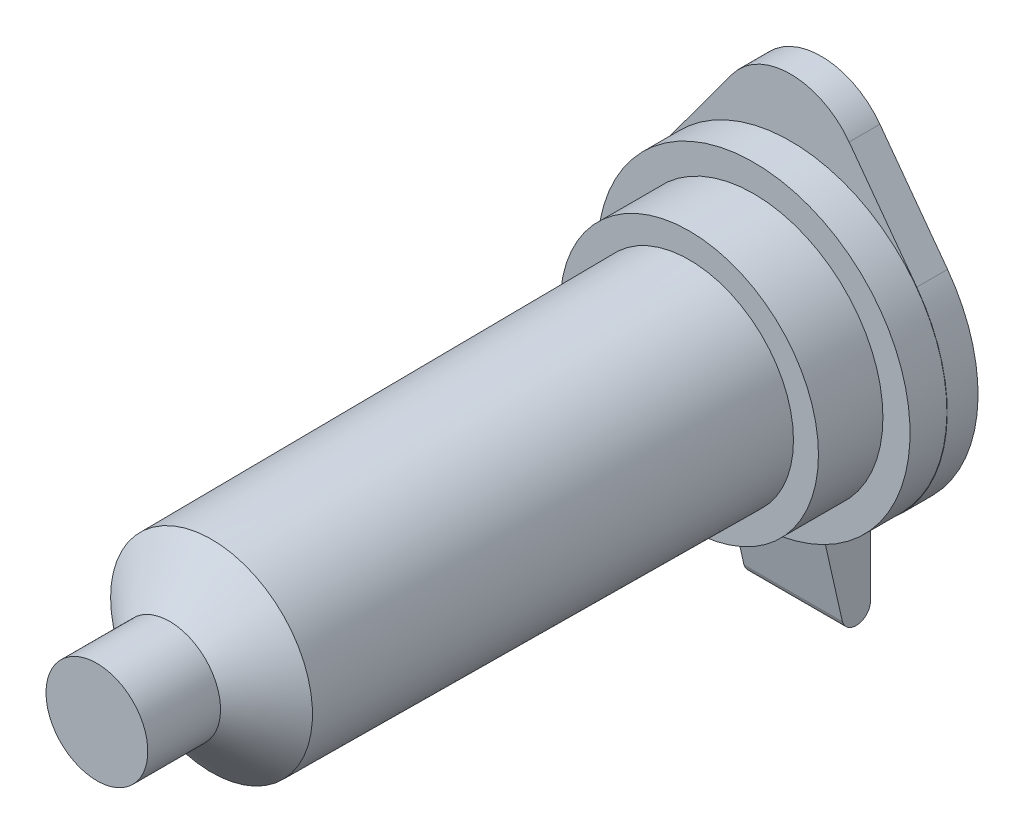
ISO-10303-21;
HEADER;
FILE_DESCRIPTION(('STEP AP214'),'2;1');
FILE_NAME('part.step','',(''),(''),'','','');
FILE_SCHEMA(('AUTOMOTIVE_DESIGN { 1 0 10303 214 1 1 1 1 }'));
ENDSEC;
DATA;
#1=APPLICATION_CONTEXT('core data for automotive mechanical design processes');
#2=APPLICATION_PROTOCOL_DEFINITION('international standard','automotive_design',2000,#1);
#3=PRODUCT_CONTEXT('',#1,'mechanical');
#4=PRODUCT('Part','Part','',(#3));
#5=PRODUCT_RELATED_PRODUCT_CATEGORY('part','',(#4));
#6=PRODUCT_DEFINITION_FORMATION('','',#4);
#7=PRODUCT_DEFINITION_CONTEXT('part definition',#1,'design');
#8=PRODUCT_DEFINITION('design','',#6,#7);
#9=PRODUCT_DEFINITION_SHAPE('','',#8);
#10=(LENGTH_UNIT() NAMED_UNIT(*) SI_UNIT(.MILLI.,.METRE.));
#11=(NAMED_UNIT(*) PLANE_ANGLE_UNIT() SI_UNIT($,.RADIAN.));
#12=(NAMED_UNIT(*) SI_UNIT($,.STERADIAN.) SOLID_ANGLE_UNIT());
#13=UNCERTAINTY_MEASURE_WITH_UNIT(LENGTH_MEASURE(1.E-05),#10,'distance_accuracy_value','');
#14=(GEOMETRIC_REPRESENTATION_CONTEXT(3) GLOBAL_UNCERTAINTY_ASSIGNED_CONTEXT((#13)) GLOBAL_UNIT_ASSIGNED_CONTEXT((#10,
#11,#12)) REPRESENTATION_CONTEXT('',''));
#15=CARTESIAN_POINT('',(0.,0.,0.));
#16=DIRECTION('',(0.,0.,1.));
#17=DIRECTION('',(1.,0.,0.));
#18=AXIS2_PLACEMENT_3D('',#15,#16,#17);
#19=CARTESIAN_POINT('',(0.,0.,-28.62));
#20=DIRECTION('',(0.,0.,-1.));
#21=DIRECTION('',(-1.,0.,0.));
#22=AXIS2_PLACEMENT_3D('',#19,#20,#21);
#23=CYLINDRICAL_SURFACE('',#22,6.45);
#24=CARTESIAN_POINT('',(0.,0.,-27.1));
#25=DIRECTION('',(0.,0.,-1.));
#26=DIRECTION('',(-1.,0.,0.));
#27=AXIS2_PLACEMENT_3D('',#24,#25,#26);
#28=CIRCLE('',#27,6.45);
#29=CARTESIAN_POINT('',(-6.45,0.,-27.1));
#30=VERTEX_POINT('',#29);
#31=EDGE_CURVE('E191',#30,#30,#28,.T.);
#32=ORIENTED_EDGE('',*,*,#31,.T.);
#33=EDGE_LOOP('',(#32));
#34=FACE_BOUND('',#33,.T.);
#35=DIRECTION('',(0.,0.,-1.));
#36=VECTOR('',#35,1.);
#37=CARTESIAN_POINT('',(2.03,-6.12222181891509,-28.62));
#38=LINE('',#37,#36);
#39=CARTESIAN_POINT('',(2.03,-6.12222181891509,-28.62));
#40=VERTEX_POINT('',#39);
#41=CARTESIAN_POINT('',(2.03,-6.12222181891509,-27.9064569091977));
#42=VERTEX_POINT('',#41);
#43=EDGE_CURVE('E125',#40,#42,#38,.F.);
#44=ORIENTED_EDGE('',*,*,#43,.F.);
#45=CARTESIAN_POINT('',(0.,0.,-28.62));
#46=DIRECTION('',(0.,0.,-1.));
#47=DIRECTION('',(-1.,0.,0.));
#48=AXIS2_PLACEMENT_3D('',#45,#46,#47);
#49=CIRCLE('',#48,6.45);
#50=CARTESIAN_POINT('',(-2.03,-6.12222181891509,-28.62));
#51=VERTEX_POINT('',#50);
#52=EDGE_CURVE('E188',#51,#40,#49,.T.);
#53=ORIENTED_EDGE('',*,*,#52,.F.);
#54=DIRECTION('',(0.,0.,-1.));
#55=VECTOR('',#54,1.);
#56=CARTESIAN_POINT('',(-2.03,-6.12222181891509,-28.62));
#57=LINE('',#56,#55);
#58=CARTESIAN_POINT('',(-2.03,-6.12222181891509,-27.9064569091977));
#59=VERTEX_POINT('',#58);
#60=EDGE_CURVE('E154',#51,#59,#57,.F.);
#61=ORIENTED_EDGE('',*,*,#60,.T.);
#62=CARTESIAN_POINT('',(0.,0.,-26.5247267429893));
#63=DIRECTION('',(0.,0.220153684703465,-0.975465199333881));
#64=DIRECTION('',(0.,-0.975465199333881,-0.220153684703465));
#65=AXIS2_PLACEMENT_3D('',#62,#63,#64);
#66=ELLIPSE('',#65,6.61222973859501,6.45);
#67=EDGE_CURVE('E11',#42,#59,#66,.T.);
#68=ORIENTED_EDGE('',*,*,#67,.F.);
#69=EDGE_LOOP('',(#44,#53,#61,#68));
#70=FACE_BOUND('',#69,.T.);
#71=ADVANCED_FACE('F33',(#34,#70),#23,.T.);
#72=CARTESIAN_POINT('',(0.,0.,-28.62));
#73=DIRECTION('',(0.,0.,-1.));
#74=DIRECTION('',(-1.,0.,0.));
#75=AXIS2_PLACEMENT_3D('',#72,#73,#74);
#76=PLANE('',#75);
#77=DIRECTION('',(0.,1.,0.));
#78=VECTOR('',#77,1.);
#79=CARTESIAN_POINT('',(2.03,0.,-28.62));
#80=LINE('',#79,#78);
#81=CARTESIAN_POINT('',(2.03,-6.13802289014956,-28.62));
#82=VERTEX_POINT('',#81);
#83=EDGE_CURVE('E159',#82,#40,#80,.T.);
#84=ORIENTED_EDGE('',*,*,#83,.F.);
#85=CARTESIAN_POINT('',(0.,0.,-28.62));
#86=DIRECTION('',(0.,0.,-1.));
#87=DIRECTION('',(-1.,0.,0.));
#88=AXIS2_PLACEMENT_3D('',#85,#86,#87);
#89=CIRCLE('',#88,6.465);
#90=CARTESIAN_POINT('',(5.20651750323152,3.83254491017964,-28.62));
#91=VERTEX_POINT('',#90);
#92=EDGE_CURVE('E171',#91,#82,#89,.T.);
#93=ORIENTED_EDGE('',*,*,#92,.F.);
#94=DIRECTION('',(0.592814371257485,-0.805339134297218,0.));
#95=VECTOR('',#94,1.);
#96=CARTESIAN_POINT('',(2.41601740289165,7.62344311377246,-28.62));
#97=LINE('',#96,#95);
#98=CARTESIAN_POINT('',(2.41601740289165,7.62344311377246,-28.62));
#99=VERTEX_POINT('',#98);
#100=EDGE_CURVE('E78',#99,#91,#97,.T.);
#101=ORIENTED_EDGE('',*,*,#100,.F.);
#102=CARTESIAN_POINT('',(0.,5.845,-28.62));
#103=DIRECTION('',(0.,0.,-1.));
#104=DIRECTION('',(-1.,0.,0.));
#105=AXIS2_PLACEMENT_3D('',#102,#103,#104);
#106=CIRCLE('',#105,3.);
#107=CARTESIAN_POINT('',(-2.41601740289166,7.62344311377246,-28.62));
#108=VERTEX_POINT('',#107);
#109=EDGE_CURVE('E176',#108,#99,#106,.T.);
#110=ORIENTED_EDGE('',*,*,#109,.F.);
#111=DIRECTION('',(0.592814371257485,0.805339134297218,0.));
#112=VECTOR('',#111,1.);
#113=CARTESIAN_POINT('',(-5.20651750323151,3.83254491017964,-28.62));
#114=LINE('',#113,#112);
#115=CARTESIAN_POINT('',(-5.20651750323151,3.83254491017964,-28.62));
#116=VERTEX_POINT('',#115);
#117=EDGE_CURVE('E174',#116,#108,#114,.T.);
#118=ORIENTED_EDGE('',*,*,#117,.F.);
#119=CARTESIAN_POINT('',(-2.03,-6.13802289014956,-28.62));
#120=VERTEX_POINT('',#119);
#121=EDGE_CURVE('E162',#120,#116,#89,.T.);
#122=ORIENTED_EDGE('',*,*,#121,.F.);
#123=DIRECTION('',(0.,1.,0.));
#124=VECTOR('',#123,1.);
#125=CARTESIAN_POINT('',(-2.03,0.,-28.62));
#126=LINE('',#125,#124);
#127=EDGE_CURVE('E48',#120,#51,#126,.T.);
#128=ORIENTED_EDGE('',*,*,#127,.T.);
#129=ORIENTED_EDGE('',*,*,#52,.T.);
#130=EDGE_LOOP('',(#84,#93,#101,#110,#118,#122,#128,#129));
#131=FACE_BOUND('',#130,.T.);
#132=ADVANCED_FACE('F221',(#131),#76,.F.);
#133=CARTESIAN_POINT('',(0.,0.,-29.89));
#134=DIRECTION('',(0.,0.,1.));
#135=DIRECTION('',(1.,0.,0.));
#136=AXIS2_PLACEMENT_3D('',#133,#134,#135);
#137=CYLINDRICAL_SURFACE('',#136,6.465);
#138=DIRECTION('',(0.,0.,1.));
#139=VECTOR('',#138,1.);
#140=CARTESIAN_POINT('',(2.03,-6.13802289014956,-29.89));
#141=LINE('',#140,#139);
#142=CARTESIAN_POINT('',(2.03,-6.13802289014956,-29.89));
#143=VERTEX_POINT('',#142);
#144=EDGE_CURVE('E157',#143,#82,#141,.T.);
#145=ORIENTED_EDGE('',*,*,#144,.F.);
#146=CARTESIAN_POINT('',(0.,0.,-29.89));
#147=DIRECTION('',(0.,0.,-1.));
#148=DIRECTION('',(-1.,0.,0.));
#149=AXIS2_PLACEMENT_3D('',#146,#147,#148);
#150=CIRCLE('',#149,6.465);
#151=CARTESIAN_POINT('',(5.20651750323152,3.83254491017964,-29.89));
#152=VERTEX_POINT('',#151);
#153=EDGE_CURVE('E163',#152,#143,#150,.T.);
#154=ORIENTED_EDGE('',*,*,#153,.F.);
#155=DIRECTION('',(0.,0.,1.));
#156=VECTOR('',#155,1.);
#157=CARTESIAN_POINT('',(5.20651750323152,3.83254491017964,-29.89));
#158=LINE('',#157,#156);
#159=EDGE_CURVE('E170',#152,#91,#158,.T.);
#160=ORIENTED_EDGE('',*,*,#159,.T.);
#161=ORIENTED_EDGE('',*,*,#92,.T.);
#162=EDGE_LOOP('',(#145,#154,#160,#161));
#163=FACE_BOUND('',#162,.T.);
#164=ADVANCED_FACE('F214',(#163),#137,.T.);
#165=CARTESIAN_POINT('',(0.,0.,0.));
#166=DIRECTION('',(0.,0.,-1.));
#167=DIRECTION('',(-1.,0.,0.));
#168=AXIS2_PLACEMENT_3D('',#165,#166,#167);
#169=PLANE('',#168);
#170=CARTESIAN_POINT('',(0.,0.,0.));
#171=DIRECTION('',(0.,0.,-1.));
#172=DIRECTION('',(-1.,0.,0.));
#173=AXIS2_PLACEMENT_3D('',#170,#171,#172);
#174=CIRCLE('',#173,2.1);
#175=CARTESIAN_POINT('',(-2.1,0.,0.));
#176=VERTEX_POINT('',#175);
#177=EDGE_CURVE('E41',#176,#176,#174,.T.);
#178=ORIENTED_EDGE('',*,*,#177,.F.);
#179=EDGE_LOOP('',(#178));
#180=FACE_BOUND('',#179,.T.);
#181=ADVANCED_FACE('F35',(#180),#169,.F.);
#182=CARTESIAN_POINT('',(0.,0.,-28.62));
#183=DIRECTION('',(0.,0.,-1.));
#184=DIRECTION('',(-1.,0.,0.));
#185=AXIS2_PLACEMENT_3D('',#182,#183,#184);
#186=CYLINDRICAL_SURFACE('',#185,2.1);
#187=CARTESIAN_POINT('',(0.,0.,-3.));
#188=DIRECTION('',(0.,0.,-1.));
#189=DIRECTION('',(-1.,0.,0.));
#190=AXIS2_PLACEMENT_3D('',#187,#188,#189);
#191=CIRCLE('',#190,2.1);
#192=CARTESIAN_POINT('',(-2.1,0.,-3.));
#193=VERTEX_POINT('',#192);
#194=EDGE_CURVE('E206',#193,#193,#191,.T.);
#195=ORIENTED_EDGE('',*,*,#194,.F.);
#196=EDGE_LOOP('',(#195));
#197=FACE_BOUND('',#196,.T.);
#198=ORIENTED_EDGE('',*,*,#177,.T.);
#199=EDGE_LOOP('',(#198));
#200=FACE_BOUND('',#199,.T.);
#201=ADVANCED_FACE('F211',(#197,#200),#186,.T.);
#202=CARTESIAN_POINT('',(0.,0.,-3.));
#203=DIRECTION('',(0.,0.,-1.));
#204=DIRECTION('',(-1.,0.,0.));
#205=AXIS2_PLACEMENT_3D('',#202,#203,#204);
#206=CONICAL_SURFACE('',#205,2.1,0.873443988111389);
#207=CARTESIAN_POINT('',(0.,0.,-4.73));
#208=DIRECTION('',(0.,0.,-1.));
#209=DIRECTION('',(-1.,0.,0.));
#210=AXIS2_PLACEMENT_3D('',#207,#208,#209);
#211=CIRCLE('',#210,4.165);
#212=CARTESIAN_POINT('',(-4.165,0.,-4.73));
#213=VERTEX_POINT('',#212);
#214=EDGE_CURVE('E203',#213,#213,#211,.T.);
#215=ORIENTED_EDGE('',*,*,#214,.F.);
#216=EDGE_LOOP('',(#215));
#217=FACE_BOUND('',#216,.T.);
#218=ORIENTED_EDGE('',*,*,#194,.T.);
#219=EDGE_LOOP('',(#218));
#220=FACE_BOUND('',#219,.T.);
#221=ADVANCED_FACE('F219',(#217,#220),#206,.T.);
#222=CARTESIAN_POINT('',(0.,0.,-4.73));
#223=DIRECTION('',(0.,0.,-1.));
#224=DIRECTION('',(-1.,0.,0.));
#225=AXIS2_PLACEMENT_3D('',#222,#223,#224);
#226=CONICAL_SURFACE('',#225,4.165,0.00684920796393491);
#227=CARTESIAN_POINT('',(0.,0.,-24.44));
#228=DIRECTION('',(0.,0.,-1.));
#229=DIRECTION('',(-1.,0.,0.));
#230=AXIS2_PLACEMENT_3D('',#227,#228,#229);
#231=CIRCLE('',#230,4.3);
#232=CARTESIAN_POINT('',(-4.3,0.,-24.44));
#233=VERTEX_POINT('',#232);
#234=EDGE_CURVE('E200',#233,#233,#231,.T.);
#235=ORIENTED_EDGE('',*,*,#234,.F.);
#236=EDGE_LOOP('',(#235));
#237=FACE_BOUND('',#236,.T.);
#238=ORIENTED_EDGE('',*,*,#214,.T.);
#239=EDGE_LOOP('',(#238));
#240=FACE_BOUND('',#239,.T.);
#241=ADVANCED_FACE('F247',(#237,#240),#226,.T.);
#242=CARTESIAN_POINT('',(4.3,0.,-24.44));
#243=DIRECTION('',(0.,0.,-1.));
#244=DIRECTION('',(-1.,0.,0.));
#245=AXIS2_PLACEMENT_3D('',#242,#243,#244);
#246=PLANE('',#245);
#247=CARTESIAN_POINT('',(0.,0.,-24.44));
#248=DIRECTION('',(0.,0.,-1.));
#249=DIRECTION('',(-1.,0.,0.));
#250=AXIS2_PLACEMENT_3D('',#247,#248,#249);
#251=CIRCLE('',#250,5.33);
#252=CARTESIAN_POINT('',(-5.33,0.,-24.44));
#253=VERTEX_POINT('',#252);
#254=EDGE_CURVE('E197',#253,#253,#251,.T.);
#255=ORIENTED_EDGE('',*,*,#254,.F.);
#256=EDGE_LOOP('',(#255));
#257=FACE_BOUND('',#256,.T.);
#258=ORIENTED_EDGE('',*,*,#234,.T.);
#259=EDGE_LOOP('',(#258));
#260=FACE_BOUND('',#259,.T.);
#261=ADVANCED_FACE('F243',(#257,#260),#246,.F.);
#262=CARTESIAN_POINT('',(0.,0.,-28.62));
#263=DIRECTION('',(0.,0.,-1.));
#264=DIRECTION('',(-1.,0.,0.));
#265=AXIS2_PLACEMENT_3D('',#262,#263,#264);
#266=CYLINDRICAL_SURFACE('',#265,5.33);
#267=CARTESIAN_POINT('',(0.,0.,-27.1));
#268=DIRECTION('',(0.,0.,-1.));
#269=DIRECTION('',(-1.,0.,0.));
#270=AXIS2_PLACEMENT_3D('',#267,#268,#269);
#271=CIRCLE('',#270,5.33);
#272=CARTESIAN_POINT('',(-5.33,0.,-27.1));
#273=VERTEX_POINT('',#272);
#274=EDGE_CURVE('E194',#273,#273,#271,.T.);
#275=ORIENTED_EDGE('',*,*,#274,.F.);
#276=EDGE_LOOP('',(#275));
#277=FACE_BOUND('',#276,.T.);
#278=ORIENTED_EDGE('',*,*,#254,.T.);
#279=EDGE_LOOP('',(#278));
#280=FACE_BOUND('',#279,.T.);
#281=ADVANCED_FACE('F239',(#277,#280),#266,.T.);
#282=CARTESIAN_POINT('',(5.33,0.,-27.1));
#283=DIRECTION('',(0.,0.,-1.));
#284=DIRECTION('',(-1.,0.,0.));
#285=AXIS2_PLACEMENT_3D('',#282,#283,#284);
#286=PLANE('',#285);
#287=ORIENTED_EDGE('',*,*,#31,.F.);
#288=EDGE_LOOP('',(#287));
#289=FACE_BOUND('',#288,.T.);
#290=ORIENTED_EDGE('',*,*,#274,.T.);
#291=EDGE_LOOP('',(#290));
#292=FACE_BOUND('',#291,.T.);
#293=ADVANCED_FACE('F236',(#289,#292),#286,.F.);
#294=CARTESIAN_POINT('',(-2.03,-6.13802289014956,-29.89));
#295=VERTEX_POINT('',#294);
#296=CARTESIAN_POINT('',(-5.20651750323151,3.83254491017964,-29.89));
#297=VERTEX_POINT('',#296);
#298=EDGE_CURVE('E85',#295,#297,#150,.T.);
#299=ORIENTED_EDGE('',*,*,#298,.F.);
#300=DIRECTION('',(0.,0.,1.));
#301=VECTOR('',#300,1.);
#302=CARTESIAN_POINT('',(-2.03,-6.13802289014956,-29.89));
#303=LINE('',#302,#301);
#304=EDGE_CURVE('E137',#295,#120,#303,.T.);
#305=ORIENTED_EDGE('',*,*,#304,.T.);
#306=ORIENTED_EDGE('',*,*,#121,.T.);
#307=DIRECTION('',(0.,0.,1.));
#308=VECTOR('',#307,1.);
#309=CARTESIAN_POINT('',(-5.20651750323151,3.83254491017964,-29.89));
#310=LINE('',#309,#308);
#311=EDGE_CURVE('E185',#297,#116,#310,.T.);
#312=ORIENTED_EDGE('',*,*,#311,.F.);
#313=EDGE_LOOP('',(#299,#305,#306,#312));
#314=FACE_BOUND('',#313,.T.);
#315=ADVANCED_FACE('F224',(#314),#137,.T.);
#316=CARTESIAN_POINT('',(-5.20651750323151,3.83254491017964,-29.89));
#317=DIRECTION('',(0.805339134297218,-0.592814371257485,0.));
#318=DIRECTION('',(0.592814371257485,0.805339134297218,0.));
#319=AXIS2_PLACEMENT_3D('',#316,#317,#318);
#320=PLANE('',#319);
#321=ORIENTED_EDGE('',*,*,#117,.T.);
#322=DIRECTION('',(0.,0.,1.));
#323=VECTOR('',#322,1.);
#324=CARTESIAN_POINT('',(-2.41601740289166,7.62344311377246,-29.89));
#325=LINE('',#324,#323);
#326=CARTESIAN_POINT('',(-2.41601740289166,7.62344311377246,-29.89));
#327=VERTEX_POINT('',#326);
#328=EDGE_CURVE('E182',#327,#108,#325,.T.);
#329=ORIENTED_EDGE('',*,*,#328,.F.);
#330=DIRECTION('',(0.592814371257485,0.805339134297218,0.));
#331=VECTOR('',#330,1.);
#332=CARTESIAN_POINT('',(-5.20651750323151,3.83254491017964,-29.89));
#333=LINE('',#332,#331);
#334=EDGE_CURVE('E165',#297,#327,#333,.T.);
#335=ORIENTED_EDGE('',*,*,#334,.F.);
#336=ORIENTED_EDGE('',*,*,#311,.T.);
#337=EDGE_LOOP('',(#321,#329,#335,#336));
#338=FACE_BOUND('',#337,.T.);
#339=ADVANCED_FACE('F285',(#338),#320,.F.);
#340=CARTESIAN_POINT('',(0.,5.845,-29.89));
#341=DIRECTION('',(0.,0.,1.));
#342=DIRECTION('',(1.,0.,0.));
#343=AXIS2_PLACEMENT_3D('',#340,#341,#342);
#344=CYLINDRICAL_SURFACE('',#343,3.);
#345=ORIENTED_EDGE('',*,*,#109,.T.);
#346=DIRECTION('',(0.,0.,1.));
#347=VECTOR('',#346,1.);
#348=CARTESIAN_POINT('',(2.41601740289165,7.62344311377246,-29.89));
#349=LINE('',#348,#347);
#350=CARTESIAN_POINT('',(2.41601740289165,7.62344311377246,-29.89));
#351=VERTEX_POINT('',#350);
#352=EDGE_CURVE('E180',#351,#99,#349,.T.);
#353=ORIENTED_EDGE('',*,*,#352,.F.);
#354=CARTESIAN_POINT('',(0.,5.845,-29.89));
#355=DIRECTION('',(0.,0.,-1.));
#356=DIRECTION('',(-1.,0.,0.));
#357=AXIS2_PLACEMENT_3D('',#354,#355,#356);
#358=CIRCLE('',#357,3.);
#359=EDGE_CURVE('E167',#327,#351,#358,.T.);
#360=ORIENTED_EDGE('',*,*,#359,.F.);
#361=ORIENTED_EDGE('',*,*,#328,.T.);
#362=EDGE_LOOP('',(#345,#353,#360,#361));
#363=FACE_BOUND('',#362,.T.);
#364=ADVANCED_FACE('F293',(#363),#344,.T.);
#365=CARTESIAN_POINT('',(2.41601740289165,7.62344311377246,-29.89));
#366=DIRECTION('',(-0.805339134297218,-0.592814371257485,0.));
#367=DIRECTION('',(0.592814371257485,-0.805339134297218,0.));
#368=AXIS2_PLACEMENT_3D('',#365,#366,#367);
#369=PLANE('',#368);
#370=ORIENTED_EDGE('',*,*,#100,.T.);
#371=ORIENTED_EDGE('',*,*,#159,.F.);
#372=DIRECTION('',(0.592814371257485,-0.805339134297218,0.));
#373=VECTOR('',#372,1.);
#374=CARTESIAN_POINT('',(2.41601740289165,7.62344311377246,-29.89));
#375=LINE('',#374,#373);
#376=EDGE_CURVE('E57',#351,#152,#375,.T.);
#377=ORIENTED_EDGE('',*,*,#376,.F.);
#378=ORIENTED_EDGE('',*,*,#352,.T.);
#379=EDGE_LOOP('',(#370,#371,#377,#378));
#380=FACE_BOUND('',#379,.T.);
#381=ADVANCED_FACE('F300',(#380),#369,.F.);
#382=CARTESIAN_POINT('',(0.,0.,-29.89));
#383=DIRECTION('',(0.,0.,-1.));
#384=DIRECTION('',(-1.,0.,0.));
#385=AXIS2_PLACEMENT_3D('',#382,#383,#384);
#386=PLANE('',#385);
#387=ORIENTED_EDGE('',*,*,#153,.T.);
#388=DIRECTION('',(0.,1.,0.));
#389=VECTOR('',#388,1.);
#390=CARTESIAN_POINT('',(2.03,-5.66788740193264,-29.89));
#391=LINE('',#390,#389);
#392=CARTESIAN_POINT('',(2.03,-9.5931218396486,-29.89));
#393=VERTEX_POINT('',#392);
#394=EDGE_CURVE('E143',#393,#143,#391,.T.);
#395=ORIENTED_EDGE('',*,*,#394,.F.);
#396=DIRECTION('',(-1.,0.,0.));
#397=VECTOR('',#396,1.);
#398=CARTESIAN_POINT('',(2.03,-9.5931218396486,-29.89));
#399=LINE('',#398,#397);
#400=CARTESIAN_POINT('',(-2.03,-9.5931218396486,-29.89));
#401=VERTEX_POINT('',#400);
#402=EDGE_CURVE('E138',#393,#401,#399,.T.);
#403=ORIENTED_EDGE('',*,*,#402,.T.);
#404=DIRECTION('',(0.,1.,0.));
#405=VECTOR('',#404,1.);
#406=CARTESIAN_POINT('',(-2.03,-5.66788740193264,-29.89));
#407=LINE('',#406,#405);
#408=EDGE_CURVE('E128',#401,#295,#407,.T.);
#409=ORIENTED_EDGE('',*,*,#408,.T.);
#410=ORIENTED_EDGE('',*,*,#298,.T.);
#411=ORIENTED_EDGE('',*,*,#334,.T.);
#412=ORIENTED_EDGE('',*,*,#359,.T.);
#413=ORIENTED_EDGE('',*,*,#376,.T.);
#414=EDGE_LOOP('',(#387,#395,#403,#409,#410,#411,#412,#413));
#415=FACE_BOUND('',#414,.T.);
#416=ADVANCED_FACE('F308',(#415),#386,.T.);
#417=CARTESIAN_POINT('',(2.03,-9.76891453524056,-28.7294825169062));
#418=DIRECTION('',(0.,0.220153684703465,-0.975465199333881));
#419=DIRECTION('',(0.,0.975465199333881,0.220153684703465));
#420=AXIS2_PLACEMENT_3D('',#417,#418,#419);
#421=PLANE('',#420);
#422=DIRECTION('',(0.,-0.97546519933388,-0.220153684703465));
#423=VECTOR('',#422,1.);
#424=CARTESIAN_POINT('',(2.03,-9.76891453524056,-28.7294825169062));
#425=LINE('',#424,#423);
#426=CARTESIAN_POINT('',(2.03,-9.76891453524056,-28.7294825169062));
#427=VERTEX_POINT('',#426);
#428=EDGE_CURVE('E118',#42,#427,#425,.T.);
#429=ORIENTED_EDGE('',*,*,#428,.F.);
#430=ORIENTED_EDGE('',*,*,#67,.T.);
#431=DIRECTION('',(0.,-0.97546519933388,-0.220153684703465));
#432=VECTOR('',#431,1.);
#433=CARTESIAN_POINT('',(-2.03,-9.76891453524056,-28.7294825169062));
#434=LINE('',#433,#432);
#435=CARTESIAN_POINT('',(-2.03,-9.76891453524056,-28.7294825169062));
#436=VERTEX_POINT('',#435);
#437=EDGE_CURVE('E134',#59,#436,#434,.T.);
#438=ORIENTED_EDGE('',*,*,#437,.T.);
#439=DIRECTION('',(-1.,0.,0.));
#440=VECTOR('',#439,1.);
#441=CARTESIAN_POINT('',(2.03,-9.76891453524056,-28.7294825169062));
#442=LINE('',#441,#440);
#443=EDGE_CURVE('E131',#427,#436,#442,.T.);
#444=ORIENTED_EDGE('',*,*,#443,.F.);
#445=EDGE_LOOP('',(#429,#430,#438,#444));
#446=FACE_BOUND('',#445,.T.);
#447=ADVANCED_FACE('F132',(#446),#421,.F.);
#448=CARTESIAN_POINT('',(2.03,-9.5931218396486,-29.296426908487));
#449=DIRECTION('',(-1.,0.,0.));
#450=DIRECTION('',(0.,0.,1.));
#451=AXIS2_PLACEMENT_3D('',#448,#449,#450);
#452=PLANE('',#451);
#453=ORIENTED_EDGE('',*,*,#83,.T.);
#454=ORIENTED_EDGE('',*,*,#43,.T.);
#455=ORIENTED_EDGE('',*,*,#428,.T.);
#456=CARTESIAN_POINT('',(2.03,-9.5931218396486,-29.296426908487));
#457=DIRECTION('',(1.,0.,0.));
#458=DIRECTION('',(0.,0.,1.));
#459=AXIS2_PLACEMENT_3D('',#456,#457,#458);
#460=CIRCLE('',#459,0.59357309151303);
#461=EDGE_CURVE('E122',#427,#393,#460,.T.);
#462=ORIENTED_EDGE('',*,*,#461,.T.);
#463=ORIENTED_EDGE('',*,*,#394,.T.);
#464=ORIENTED_EDGE('',*,*,#144,.T.);
#465=EDGE_LOOP('',(#453,#454,#455,#462,#463,#464));
#466=FACE_BOUND('',#465,.T.);
#467=ADVANCED_FACE('F120',(#466),#452,.F.);
#468=CARTESIAN_POINT('',(-2.03,-9.5931218396486,-29.296426908487));
#469=DIRECTION('',(-1.,0.,0.));
#470=DIRECTION('',(0.,0.,1.));
#471=AXIS2_PLACEMENT_3D('',#468,#469,#470);
#472=PLANE('',#471);
#473=ORIENTED_EDGE('',*,*,#60,.F.);
#474=ORIENTED_EDGE('',*,*,#127,.F.);
#475=ORIENTED_EDGE('',*,*,#304,.F.);
#476=ORIENTED_EDGE('',*,*,#408,.F.);
#477=CARTESIAN_POINT('',(-2.03,-9.5931218396486,-29.296426908487));
#478=DIRECTION('',(1.,0.,0.));
#479=DIRECTION('',(0.,0.,1.));
#480=AXIS2_PLACEMENT_3D('',#477,#478,#479);
#481=CIRCLE('',#480,0.59357309151303);
#482=EDGE_CURVE('E148',#436,#401,#481,.T.);
#483=ORIENTED_EDGE('',*,*,#482,.F.);
#484=ORIENTED_EDGE('',*,*,#437,.F.);
#485=EDGE_LOOP('',(#473,#474,#475,#476,#483,#484));
#486=FACE_BOUND('',#485,.T.);
#487=ADVANCED_FACE('F326',(#486),#472,.T.);
#488=CARTESIAN_POINT('',(2.03,-9.5931218396486,-29.296426908487));
#489=DIRECTION('',(-1.,0.,0.));
#490=DIRECTION('',(0.,0.,1.));
#491=AXIS2_PLACEMENT_3D('',#488,#489,#490);
#492=CYLINDRICAL_SURFACE('',#491,0.59357309151303);
#493=ORIENTED_EDGE('',*,*,#482,.T.);
#494=ORIENTED_EDGE('',*,*,#402,.F.);
#495=ORIENTED_EDGE('',*,*,#461,.F.);
#496=ORIENTED_EDGE('',*,*,#443,.T.);
#497=EDGE_LOOP('',(#493,#494,#495,#496));
#498=FACE_BOUND('',#497,.T.);
#499=ADVANCED_FACE('F140',(#498),#492,.T.);
#500=CLOSED_SHELL('',(#71,#132,#164,#181,#201,#221,#241,#261,#281,#293,#315,#339,#364,#381,#416,
#447,#467,#487,#499));
#501=MANIFOLD_SOLID_BREP('B2',#500);
#502=ADVANCED_BREP_SHAPE_REPRESENTATION('',(#18,#501),#14);
#503=SHAPE_DEFINITION_REPRESENTATION(#9,#502);
ENDSEC;
END-ISO-10303-21;
